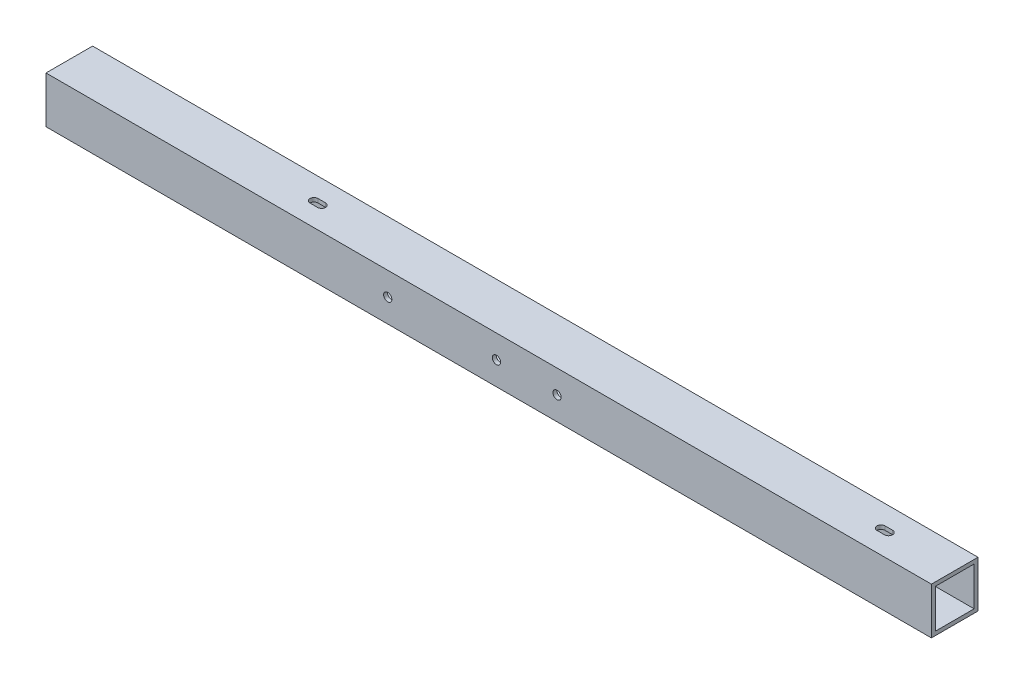
ISO-10303-21;
HEADER;
FILE_DESCRIPTION(('STEP AP214'),'2;1');
FILE_NAME('part.step','',(''),(''),'','','');
FILE_SCHEMA(('AUTOMOTIVE_DESIGN { 1 0 10303 214 1 1 1 1 }'));
ENDSEC;
DATA;
#1=APPLICATION_CONTEXT('core data for automotive mechanical design processes');
#2=APPLICATION_PROTOCOL_DEFINITION('international standard','automotive_design',2000,#1);
#3=PRODUCT_CONTEXT('',#1,'mechanical');
#4=PRODUCT('Part','Part','',(#3));
#5=PRODUCT_RELATED_PRODUCT_CATEGORY('part','',(#4));
#6=PRODUCT_DEFINITION_FORMATION('','',#4);
#7=PRODUCT_DEFINITION_CONTEXT('part definition',#1,'design');
#8=PRODUCT_DEFINITION('design','',#6,#7);
#9=PRODUCT_DEFINITION_SHAPE('','',#8);
#10=(LENGTH_UNIT() NAMED_UNIT(*) SI_UNIT(.MILLI.,.METRE.));
#11=(NAMED_UNIT(*) PLANE_ANGLE_UNIT() SI_UNIT($,.RADIAN.));
#12=(NAMED_UNIT(*) SI_UNIT($,.STERADIAN.) SOLID_ANGLE_UNIT());
#13=UNCERTAINTY_MEASURE_WITH_UNIT(LENGTH_MEASURE(1.E-05),#10,'distance_accuracy_value','');
#14=(GEOMETRIC_REPRESENTATION_CONTEXT(3) GLOBAL_UNCERTAINTY_ASSIGNED_CONTEXT((#13)) GLOBAL_UNIT_ASSIGNED_CONTEXT((#10,
#11,#12)) REPRESENTATION_CONTEXT('',''));
#15=CARTESIAN_POINT('',(0.,0.,0.));
#16=DIRECTION('',(0.,0.,1.));
#17=DIRECTION('',(1.,0.,0.));
#18=AXIS2_PLACEMENT_3D('',#15,#16,#17);
#19=CARTESIAN_POINT('',(-723.9,38.0999999999999,-38.1));
#20=DIRECTION('',(0.,-1.,0.));
#21=DIRECTION('',(1.,0.,0.));
#22=AXIS2_PLACEMENT_3D('',#19,#20,#21);
#23=PLANE('',#22);
#24=DIRECTION('',(1.,0.,0.));
#25=VECTOR('',#24,1.);
#26=CARTESIAN_POINT('',(-60.2361,38.1,-15.7861));
#27=LINE('',#26,#25);
#28=CARTESIAN_POINT('',(-60.2361,38.1,-15.7861));
#29=VERTEX_POINT('',#28);
#30=CARTESIAN_POINT('',(-54.0639,38.1,-15.7861));
#31=VERTEX_POINT('',#30);
#32=EDGE_CURVE('E252',#29,#31,#27,.T.);
#33=ORIENTED_EDGE('',*,*,#32,.F.);
#34=CARTESIAN_POINT('',(-60.2361,38.1,-19.05));
#35=DIRECTION('',(0.,-1.,0.));
#36=DIRECTION('',(0.,0.,-1.));
#37=AXIS2_PLACEMENT_3D('',#34,#35,#36);
#38=CIRCLE('',#37,3.26389999999999);
#39=CARTESIAN_POINT('',(-60.2361,38.1,-22.3139));
#40=VERTEX_POINT('',#39);
#41=EDGE_CURVE('E254',#29,#40,#38,.T.);
#42=ORIENTED_EDGE('',*,*,#41,.T.);
#43=DIRECTION('',(1.,0.,0.));
#44=VECTOR('',#43,1.);
#45=CARTESIAN_POINT('',(-60.2361,38.1,-22.3139));
#46=LINE('',#45,#44);
#47=CARTESIAN_POINT('',(-54.0639,38.1,-22.3139));
#48=VERTEX_POINT('',#47);
#49=EDGE_CURVE('E248',#40,#48,#46,.T.);
#50=ORIENTED_EDGE('',*,*,#49,.T.);
#51=CARTESIAN_POINT('',(-54.0639,38.1,-19.05));
#52=DIRECTION('',(0.,-1.,0.));
#53=DIRECTION('',(0.,0.,-1.));
#54=AXIS2_PLACEMENT_3D('',#51,#52,#53);
#55=CIRCLE('',#54,3.26389999999999);
#56=EDGE_CURVE('E255',#48,#31,#55,.T.);
#57=ORIENTED_EDGE('',*,*,#56,.T.);
#58=EDGE_LOOP('',(#33,#42,#50,#57));
#59=FACE_BOUND('',#58,.T.);
#60=DIRECTION('',(0.,0.,1.));
#61=VECTOR('',#60,1.);
#62=CARTESIAN_POINT('',(0.,38.1,-38.1));
#63=LINE('',#62,#61);
#64=CARTESIAN_POINT('',(0.,38.1,-38.1));
#65=VERTEX_POINT('',#64);
#66=CARTESIAN_POINT('',(0.,38.1,0.));
#67=VERTEX_POINT('',#66);
#68=EDGE_CURVE('E302',#65,#67,#63,.T.);
#69=ORIENTED_EDGE('',*,*,#68,.F.);
#70=DIRECTION('',(1.,0.,0.));
#71=VECTOR('',#70,1.);
#72=CARTESIAN_POINT('',(-723.9,38.0999999999999,-38.1));
#73=LINE('',#72,#71);
#74=CARTESIAN_POINT('',(-723.9,38.0999999999999,-38.1));
#75=VERTEX_POINT('',#74);
#76=EDGE_CURVE('E345',#75,#65,#73,.T.);
#77=ORIENTED_EDGE('',*,*,#76,.F.);
#78=DIRECTION('',(0.,0.,-1.));
#79=VECTOR('',#78,1.);
#80=CARTESIAN_POINT('',(-723.9,38.0999999999999,-38.1));
#81=LINE('',#80,#79);
#82=CARTESIAN_POINT('',(-723.9,38.0999999999999,0.));
#83=VERTEX_POINT('',#82);
#84=EDGE_CURVE('E320',#83,#75,#81,.T.);
#85=ORIENTED_EDGE('',*,*,#84,.F.);
#86=DIRECTION('',(1.,0.,0.));
#87=VECTOR('',#86,1.);
#88=CARTESIAN_POINT('',(-723.9,38.0999999999999,0.));
#89=LINE('',#88,#87);
#90=EDGE_CURVE('E348',#83,#67,#89,.T.);
#91=ORIENTED_EDGE('',*,*,#90,.T.);
#92=EDGE_LOOP('',(#69,#77,#85,#91));
#93=FACE_BOUND('',#92,.T.);
#94=DIRECTION('',(1.,0.,0.));
#95=VECTOR('',#94,1.);
#96=CARTESIAN_POINT('',(-523.7861,38.0999999999999,-15.7861));
#97=LINE('',#96,#95);
#98=CARTESIAN_POINT('',(-523.7861,38.0999999999999,-15.7861));
#99=VERTEX_POINT('',#98);
#100=CARTESIAN_POINT('',(-517.6139,38.0999999999999,-15.7861));
#101=VERTEX_POINT('',#100);
#102=EDGE_CURVE('E229',#99,#101,#97,.T.);
#103=ORIENTED_EDGE('',*,*,#102,.F.);
#104=CARTESIAN_POINT('',(-523.7861,38.0999999999999,-19.05));
#105=DIRECTION('',(0.,-1.,0.));
#106=DIRECTION('',(0.,0.,-1.));
#107=AXIS2_PLACEMENT_3D('',#104,#105,#106);
#108=CIRCLE('',#107,3.26389999999999);
#109=CARTESIAN_POINT('',(-523.7861,38.0999999999999,-22.3139));
#110=VERTEX_POINT('',#109);
#111=EDGE_CURVE('E226',#99,#110,#108,.T.);
#112=ORIENTED_EDGE('',*,*,#111,.T.);
#113=DIRECTION('',(1.,0.,0.));
#114=VECTOR('',#113,1.);
#115=CARTESIAN_POINT('',(-523.7861,38.0999999999999,-22.3139));
#116=LINE('',#115,#114);
#117=CARTESIAN_POINT('',(-517.6139,38.0999999999999,-22.3139));
#118=VERTEX_POINT('',#117);
#119=EDGE_CURVE('E207',#110,#118,#116,.T.);
#120=ORIENTED_EDGE('',*,*,#119,.T.);
#121=CARTESIAN_POINT('',(-517.6139,38.0999999999999,-19.05));
#122=DIRECTION('',(0.,-1.,0.));
#123=DIRECTION('',(0.,0.,-1.));
#124=AXIS2_PLACEMENT_3D('',#121,#122,#123);
#125=CIRCLE('',#124,3.26389999999999);
#126=EDGE_CURVE('E233',#118,#101,#125,.T.);
#127=ORIENTED_EDGE('',*,*,#126,.T.);
#128=EDGE_LOOP('',(#103,#112,#120,#127));
#129=FACE_BOUND('',#128,.T.);
#130=ADVANCED_FACE('F33',(#59,#93,#129),#23,.F.);
#131=CARTESIAN_POINT('',(-723.9,0.,-38.1));
#132=DIRECTION('',(0.,1.,0.));
#133=DIRECTION('',(-1.,0.,0.));
#134=AXIS2_PLACEMENT_3D('',#131,#132,#133);
#135=PLANE('',#134);
#136=DIRECTION('',(1.,0.,0.));
#137=VECTOR('',#136,1.);
#138=CARTESIAN_POINT('',(-523.7861,0.,-15.7861));
#139=LINE('',#138,#137);
#140=CARTESIAN_POINT('',(-523.7861,0.,-15.7861));
#141=VERTEX_POINT('',#140);
#142=CARTESIAN_POINT('',(-517.6139,0.,-15.7861));
#143=VERTEX_POINT('',#142);
#144=EDGE_CURVE('E196',#141,#143,#139,.T.);
#145=ORIENTED_EDGE('',*,*,#144,.T.);
#146=CARTESIAN_POINT('',(-517.6139,0.,-19.05));
#147=DIRECTION('',(0.,-1.,0.));
#148=DIRECTION('',(0.,0.,-1.));
#149=AXIS2_PLACEMENT_3D('',#146,#147,#148);
#150=CIRCLE('',#149,3.26389999999999);
#151=CARTESIAN_POINT('',(-517.6139,0.,-22.3139));
#152=VERTEX_POINT('',#151);
#153=EDGE_CURVE('E216',#152,#143,#150,.T.);
#154=ORIENTED_EDGE('',*,*,#153,.F.);
#155=DIRECTION('',(1.,0.,0.));
#156=VECTOR('',#155,1.);
#157=CARTESIAN_POINT('',(-523.7861,0.,-22.3139));
#158=LINE('',#157,#156);
#159=CARTESIAN_POINT('',(-523.7861,0.,-22.3139));
#160=VERTEX_POINT('',#159);
#161=EDGE_CURVE('E219',#160,#152,#158,.T.);
#162=ORIENTED_EDGE('',*,*,#161,.F.);
#163=CARTESIAN_POINT('',(-523.7861,0.,-19.05));
#164=DIRECTION('',(0.,-1.,0.));
#165=DIRECTION('',(0.,0.,-1.));
#166=AXIS2_PLACEMENT_3D('',#163,#164,#165);
#167=CIRCLE('',#166,3.26389999999999);
#168=EDGE_CURVE('E206',#141,#160,#167,.T.);
#169=ORIENTED_EDGE('',*,*,#168,.F.);
#170=EDGE_LOOP('',(#145,#154,#162,#169));
#171=FACE_BOUND('',#170,.T.);
#172=DIRECTION('',(1.,0.,0.));
#173=VECTOR('',#172,1.);
#174=CARTESIAN_POINT('',(-60.2361,0.,-22.3139));
#175=LINE('',#174,#173);
#176=CARTESIAN_POINT('',(-60.2361,0.,-22.3139));
#177=VERTEX_POINT('',#176);
#178=CARTESIAN_POINT('',(-54.0639,0.,-22.3139));
#179=VERTEX_POINT('',#178);
#180=EDGE_CURVE('E245',#177,#179,#175,.T.);
#181=ORIENTED_EDGE('',*,*,#180,.F.);
#182=CARTESIAN_POINT('',(-60.2361,0.,-19.05));
#183=DIRECTION('',(0.,-1.,0.));
#184=DIRECTION('',(0.,0.,-1.));
#185=AXIS2_PLACEMENT_3D('',#182,#183,#184);
#186=CIRCLE('',#185,3.26389999999999);
#187=CARTESIAN_POINT('',(-60.2361,0.,-15.7861));
#188=VERTEX_POINT('',#187);
#189=EDGE_CURVE('E258',#188,#177,#186,.T.);
#190=ORIENTED_EDGE('',*,*,#189,.F.);
#191=DIRECTION('',(1.,0.,0.));
#192=VECTOR('',#191,1.);
#193=CARTESIAN_POINT('',(-60.2361,0.,-15.7861));
#194=LINE('',#193,#192);
#195=CARTESIAN_POINT('',(-54.0639,0.,-15.7861));
#196=VERTEX_POINT('',#195);
#197=EDGE_CURVE('E251',#188,#196,#194,.T.);
#198=ORIENTED_EDGE('',*,*,#197,.T.);
#199=CARTESIAN_POINT('',(-54.0639,0.,-19.05));
#200=DIRECTION('',(0.,-1.,0.));
#201=DIRECTION('',(0.,0.,-1.));
#202=AXIS2_PLACEMENT_3D('',#199,#200,#201);
#203=CIRCLE('',#202,3.26389999999999);
#204=EDGE_CURVE('E271',#179,#196,#203,.T.);
#205=ORIENTED_EDGE('',*,*,#204,.F.);
#206=EDGE_LOOP('',(#181,#190,#198,#205));
#207=FACE_BOUND('',#206,.T.);
#208=DIRECTION('',(0.,0.,-1.));
#209=VECTOR('',#208,1.);
#210=CARTESIAN_POINT('',(0.,0.,-38.1));
#211=LINE('',#210,#209);
#212=CARTESIAN_POINT('',(0.,0.,0.));
#213=VERTEX_POINT('',#212);
#214=CARTESIAN_POINT('',(0.,0.,-38.1));
#215=VERTEX_POINT('',#214);
#216=EDGE_CURVE('E296',#213,#215,#211,.T.);
#217=ORIENTED_EDGE('',*,*,#216,.F.);
#218=DIRECTION('',(1.,0.,0.));
#219=VECTOR('',#218,1.);
#220=CARTESIAN_POINT('',(-723.9,0.,0.));
#221=LINE('',#220,#219);
#222=CARTESIAN_POINT('',(-723.9,0.,0.));
#223=VERTEX_POINT('',#222);
#224=EDGE_CURVE('E334',#223,#213,#221,.T.);
#225=ORIENTED_EDGE('',*,*,#224,.F.);
#226=DIRECTION('',(0.,0.,1.));
#227=VECTOR('',#226,1.);
#228=CARTESIAN_POINT('',(-723.9,0.,-38.1));
#229=LINE('',#228,#227);
#230=CARTESIAN_POINT('',(-723.9,-5.34294830600857E-13,-38.1));
#231=VERTEX_POINT('',#230);
#232=EDGE_CURVE('E326',#231,#223,#229,.T.);
#233=ORIENTED_EDGE('',*,*,#232,.F.);
#234=DIRECTION('',(1.,0.,0.));
#235=VECTOR('',#234,1.);
#236=CARTESIAN_POINT('',(-723.9,0.,-38.1));
#237=LINE('',#236,#235);
#238=EDGE_CURVE('E329',#231,#215,#237,.T.);
#239=ORIENTED_EDGE('',*,*,#238,.T.);
#240=EDGE_LOOP('',(#217,#225,#233,#239));
#241=FACE_BOUND('',#240,.T.);
#242=ADVANCED_FACE('F35',(#171,#207,#241),#135,.F.);
#243=CARTESIAN_POINT('',(-723.9,38.0999999999999,0.));
#244=DIRECTION('',(0.,0.,-1.));
#245=DIRECTION('',(-1.,0.,0.));
#246=AXIS2_PLACEMENT_3D('',#243,#244,#245);
#247=PLANE('',#246);
#248=CARTESIAN_POINT('',(-444.5,19.0499999999999,0.));
#249=DIRECTION('',(0.,0.,1.));
#250=DIRECTION('',(1.,0.,0.));
#251=AXIS2_PLACEMENT_3D('',#248,#249,#250);
#252=CIRCLE('',#251,3.3782);
#253=CARTESIAN_POINT('',(-441.1218,19.0499999999999,0.));
#254=VERTEX_POINT('',#253);
#255=EDGE_CURVE('E450',#254,#254,#252,.T.);
#256=ORIENTED_EDGE('',*,*,#255,.F.);
#257=EDGE_LOOP('',(#256));
#258=FACE_BOUND('',#257,.T.);
#259=CARTESIAN_POINT('',(-355.6,19.0499999999999,0.));
#260=DIRECTION('',(0.,0.,1.));
#261=DIRECTION('',(1.,0.,0.));
#262=AXIS2_PLACEMENT_3D('',#259,#260,#261);
#263=CIRCLE('',#262,3.3782);
#264=CARTESIAN_POINT('',(-352.2218,19.0499999999999,0.));
#265=VERTEX_POINT('',#264);
#266=EDGE_CURVE('E454',#265,#265,#263,.T.);
#267=ORIENTED_EDGE('',*,*,#266,.F.);
#268=EDGE_LOOP('',(#267));
#269=FACE_BOUND('',#268,.T.);
#270=CARTESIAN_POINT('',(-306.07,19.05,0.));
#271=DIRECTION('',(0.,0.,1.));
#272=DIRECTION('',(1.,0.,0.));
#273=AXIS2_PLACEMENT_3D('',#270,#271,#272);
#274=CIRCLE('',#273,3.3782);
#275=CARTESIAN_POINT('',(-302.6918,19.05,0.));
#276=VERTEX_POINT('',#275);
#277=EDGE_CURVE('E386',#276,#276,#274,.T.);
#278=ORIENTED_EDGE('',*,*,#277,.F.);
#279=EDGE_LOOP('',(#278));
#280=FACE_BOUND('',#279,.T.);
#281=DIRECTION('',(0.,-1.,0.));
#282=VECTOR('',#281,1.);
#283=CARTESIAN_POINT('',(0.,38.0999999999999,0.));
#284=LINE('',#283,#282);
#285=EDGE_CURVE('E299',#67,#213,#284,.T.);
#286=ORIENTED_EDGE('',*,*,#285,.F.);
#287=ORIENTED_EDGE('',*,*,#90,.F.);
#288=DIRECTION('',(0.,1.,0.));
#289=VECTOR('',#288,1.);
#290=CARTESIAN_POINT('',(-723.9,38.0999999999999,0.));
#291=LINE('',#290,#289);
#292=EDGE_CURVE('E323',#223,#83,#291,.T.);
#293=ORIENTED_EDGE('',*,*,#292,.F.);
#294=ORIENTED_EDGE('',*,*,#224,.T.);
#295=EDGE_LOOP('',(#286,#287,#293,#294));
#296=FACE_BOUND('',#295,.T.);
#297=ADVANCED_FACE('F434',(#258,#269,#280,#296),#247,.F.);
#298=CARTESIAN_POINT('',(-723.9,38.0999999999999,-38.1));
#299=DIRECTION('',(0.,0.,1.));
#300=DIRECTION('',(1.,0.,0.));
#301=AXIS2_PLACEMENT_3D('',#298,#299,#300);
#302=PLANE('',#301);
#303=CARTESIAN_POINT('',(-444.5,19.0499999999999,-38.1));
#304=DIRECTION('',(0.,0.,1.));
#305=DIRECTION('',(1.,0.,0.));
#306=AXIS2_PLACEMENT_3D('',#303,#304,#305);
#307=CIRCLE('',#306,3.3782);
#308=CARTESIAN_POINT('',(-441.1218,19.0499999999999,-38.1));
#309=VERTEX_POINT('',#308);
#310=EDGE_CURVE('E709',#309,#309,#307,.T.);
#311=ORIENTED_EDGE('',*,*,#310,.T.);
#312=EDGE_LOOP('',(#311));
#313=FACE_BOUND('',#312,.T.);
#314=CARTESIAN_POINT('',(-355.6,19.0499999999999,-38.1));
#315=DIRECTION('',(0.,0.,1.));
#316=DIRECTION('',(1.,0.,0.));
#317=AXIS2_PLACEMENT_3D('',#314,#315,#316);
#318=CIRCLE('',#317,3.3782);
#319=CARTESIAN_POINT('',(-352.2218,19.0499999999999,-38.1));
#320=VERTEX_POINT('',#319);
#321=EDGE_CURVE('E716',#320,#320,#318,.T.);
#322=ORIENTED_EDGE('',*,*,#321,.T.);
#323=EDGE_LOOP('',(#322));
#324=FACE_BOUND('',#323,.T.);
#325=CARTESIAN_POINT('',(-306.07,19.05,-38.1));
#326=DIRECTION('',(0.,0.,1.));
#327=DIRECTION('',(1.,0.,0.));
#328=AXIS2_PLACEMENT_3D('',#325,#326,#327);
#329=CIRCLE('',#328,3.3782);
#330=CARTESIAN_POINT('',(-302.6918,19.05,-38.1));
#331=VERTEX_POINT('',#330);
#332=EDGE_CURVE('E380',#331,#331,#329,.T.);
#333=ORIENTED_EDGE('',*,*,#332,.T.);
#334=EDGE_LOOP('',(#333));
#335=FACE_BOUND('',#334,.T.);
#336=DIRECTION('',(0.,1.,0.));
#337=VECTOR('',#336,1.);
#338=CARTESIAN_POINT('',(0.,38.0999999999999,-38.1));
#339=LINE('',#338,#337);
#340=EDGE_CURVE('E305',#215,#65,#339,.T.);
#341=ORIENTED_EDGE('',*,*,#340,.F.);
#342=ORIENTED_EDGE('',*,*,#238,.F.);
#343=DIRECTION('',(0.,-1.,0.));
#344=VECTOR('',#343,1.);
#345=CARTESIAN_POINT('',(-723.9,38.0999999999999,-38.1));
#346=LINE('',#345,#344);
#347=EDGE_CURVE('E317',#75,#231,#346,.T.);
#348=ORIENTED_EDGE('',*,*,#347,.F.);
#349=ORIENTED_EDGE('',*,*,#76,.T.);
#350=EDGE_LOOP('',(#341,#342,#348,#349));
#351=FACE_BOUND('',#350,.T.);
#352=ADVANCED_FACE('F438',(#313,#324,#335,#351),#302,.F.);
#353=CARTESIAN_POINT('',(-723.9,-2.22044604925031E-13,-38.1));
#354=DIRECTION('',(-1.,0.,0.));
#355=DIRECTION('',(0.,-1.,0.));
#356=AXIS2_PLACEMENT_3D('',#353,#354,#355);
#357=PLANE('',#356);
#358=DIRECTION('',(0.,0.,1.));
#359=VECTOR('',#358,1.);
#360=CARTESIAN_POINT('',(-723.9,3.17499999999991,-34.925));
#361=LINE('',#360,#359);
#362=CARTESIAN_POINT('',(-723.9,3.17499999999947,-34.925));
#363=VERTEX_POINT('',#362);
#364=CARTESIAN_POINT('',(-723.9,3.17499999999947,-3.175));
#365=VERTEX_POINT('',#364);
#366=EDGE_CURVE('E314',#363,#365,#361,.T.);
#367=ORIENTED_EDGE('',*,*,#366,.F.);
#368=DIRECTION('',(0.,-1.,0.));
#369=VECTOR('',#368,1.);
#370=CARTESIAN_POINT('',(-723.9,34.9249999999999,-34.925));
#371=LINE('',#370,#369);
#372=CARTESIAN_POINT('',(-723.9,34.9249999999999,-34.925));
#373=VERTEX_POINT('',#372);
#374=EDGE_CURVE('E311',#373,#363,#371,.T.);
#375=ORIENTED_EDGE('',*,*,#374,.F.);
#376=DIRECTION('',(0.,0.,-1.));
#377=VECTOR('',#376,1.);
#378=CARTESIAN_POINT('',(-723.9,34.9249999999999,-34.925));
#379=LINE('',#378,#377);
#380=CARTESIAN_POINT('',(-723.9,34.9249999999999,-3.175));
#381=VERTEX_POINT('',#380);
#382=EDGE_CURVE('E308',#381,#373,#379,.T.);
#383=ORIENTED_EDGE('',*,*,#382,.F.);
#384=DIRECTION('',(0.,1.,0.));
#385=VECTOR('',#384,1.);
#386=CARTESIAN_POINT('',(-723.9,34.9249999999999,-3.175));
#387=LINE('',#386,#385);
#388=EDGE_CURVE('E343',#365,#381,#387,.T.);
#389=ORIENTED_EDGE('',*,*,#388,.F.);
#390=EDGE_LOOP('',(#367,#375,#383,#389));
#391=FACE_BOUND('',#390,.T.);
#392=ORIENTED_EDGE('',*,*,#347,.T.);
#393=ORIENTED_EDGE('',*,*,#232,.T.);
#394=ORIENTED_EDGE('',*,*,#292,.T.);
#395=ORIENTED_EDGE('',*,*,#84,.T.);
#396=EDGE_LOOP('',(#392,#393,#394,#395));
#397=FACE_BOUND('',#396,.T.);
#398=ADVANCED_FACE('F445',(#391,#397),#357,.T.);
#399=CARTESIAN_POINT('',(-723.9,3.17499999999991,-34.925));
#400=DIRECTION('',(0.,1.,0.));
#401=DIRECTION('',(-1.,0.,0.));
#402=AXIS2_PLACEMENT_3D('',#399,#400,#401);
#403=PLANE('',#402);
#404=DIRECTION('',(1.,0.,0.));
#405=VECTOR('',#404,1.);
#406=CARTESIAN_POINT('',(-723.9,3.17499999999991,-15.7861));
#407=LINE('',#406,#405);
#408=CARTESIAN_POINT('',(-523.7861,3.17499999999994,-15.7861));
#409=VERTEX_POINT('',#408);
#410=CARTESIAN_POINT('',(-517.6139,3.17499999999994,-15.7861));
#411=VERTEX_POINT('',#410);
#412=EDGE_CURVE('E242',#409,#411,#407,.T.);
#413=ORIENTED_EDGE('',*,*,#412,.F.);
#414=CARTESIAN_POINT('',(-523.7861,3.17499999999994,-19.05));
#415=DIRECTION('',(0.,1.,0.));
#416=DIRECTION('',(-1.,0.,0.));
#417=AXIS2_PLACEMENT_3D('',#414,#415,#416);
#418=CIRCLE('',#417,3.26389999999999);
#419=CARTESIAN_POINT('',(-523.7861,3.17499999999994,-22.3139));
#420=VERTEX_POINT('',#419);
#421=EDGE_CURVE('E215',#420,#409,#418,.T.);
#422=ORIENTED_EDGE('',*,*,#421,.F.);
#423=DIRECTION('',(-1.,0.,0.));
#424=VECTOR('',#423,1.);
#425=CARTESIAN_POINT('',(-723.9,3.17499999999991,-22.3139));
#426=LINE('',#425,#424);
#427=CARTESIAN_POINT('',(-517.6139,3.17499999999994,-22.3139));
#428=VERTEX_POINT('',#427);
#429=EDGE_CURVE('E42',#428,#420,#426,.T.);
#430=ORIENTED_EDGE('',*,*,#429,.F.);
#431=CARTESIAN_POINT('',(-517.6139,3.17499999999994,-19.05));
#432=DIRECTION('',(0.,1.,0.));
#433=DIRECTION('',(-1.,0.,0.));
#434=AXIS2_PLACEMENT_3D('',#431,#432,#433);
#435=CIRCLE('',#434,3.26389999999999);
#436=EDGE_CURVE('E11',#411,#428,#435,.T.);
#437=ORIENTED_EDGE('',*,*,#436,.F.);
#438=EDGE_LOOP('',(#413,#422,#430,#437));
#439=FACE_BOUND('',#438,.T.);
#440=DIRECTION('',(-1.,0.,0.));
#441=VECTOR('',#440,1.);
#442=CARTESIAN_POINT('',(-723.9,3.17499999999991,-22.3139));
#443=LINE('',#442,#441);
#444=CARTESIAN_POINT('',(-54.0639,3.17499999999999,-22.3139));
#445=VERTEX_POINT('',#444);
#446=CARTESIAN_POINT('',(-60.2361,3.17499999999999,-22.3139));
#447=VERTEX_POINT('',#446);
#448=EDGE_CURVE('E369',#445,#447,#443,.T.);
#449=ORIENTED_EDGE('',*,*,#448,.F.);
#450=CARTESIAN_POINT('',(-54.0639,3.17499999999999,-19.05));
#451=DIRECTION('',(0.,1.,0.));
#452=DIRECTION('',(-1.,0.,0.));
#453=AXIS2_PLACEMENT_3D('',#450,#451,#452);
#454=CIRCLE('',#453,3.26389999999999);
#455=CARTESIAN_POINT('',(-54.0639,3.17499999999999,-15.7861));
#456=VERTEX_POINT('',#455);
#457=EDGE_CURVE('E285',#456,#445,#454,.T.);
#458=ORIENTED_EDGE('',*,*,#457,.F.);
#459=DIRECTION('',(1.,0.,0.));
#460=VECTOR('',#459,1.);
#461=CARTESIAN_POINT('',(-723.9,3.17499999999991,-15.7861));
#462=LINE('',#461,#460);
#463=CARTESIAN_POINT('',(-60.2360999999999,3.17499999999999,-15.7861));
#464=VERTEX_POINT('',#463);
#465=EDGE_CURVE('E364',#464,#456,#462,.T.);
#466=ORIENTED_EDGE('',*,*,#465,.F.);
#467=CARTESIAN_POINT('',(-60.2361,3.17499999999999,-19.05));
#468=DIRECTION('',(0.,1.,0.));
#469=DIRECTION('',(-1.,0.,0.));
#470=AXIS2_PLACEMENT_3D('',#467,#468,#469);
#471=CIRCLE('',#470,3.26389999999999);
#472=EDGE_CURVE('E366',#447,#464,#471,.T.);
#473=ORIENTED_EDGE('',*,*,#472,.F.);
#474=EDGE_LOOP('',(#449,#458,#466,#473));
#475=FACE_BOUND('',#474,.T.);
#476=DIRECTION('',(1.,0.,0.));
#477=VECTOR('',#476,1.);
#478=CARTESIAN_POINT('',(-723.9,3.17499999999991,-3.175));
#479=LINE('',#478,#477);
#480=CARTESIAN_POINT('',(0.,3.175,-3.175));
#481=VERTEX_POINT('',#480);
#482=EDGE_CURVE('E330',#365,#481,#479,.T.);
#483=ORIENTED_EDGE('',*,*,#482,.T.);
#484=DIRECTION('',(0.,0.,-1.));
#485=VECTOR('',#484,1.);
#486=CARTESIAN_POINT('',(0.,3.175,-34.925));
#487=LINE('',#486,#485);
#488=CARTESIAN_POINT('',(0.,3.175,-34.925));
#489=VERTEX_POINT('',#488);
#490=EDGE_CURVE('E354',#481,#489,#487,.T.);
#491=ORIENTED_EDGE('',*,*,#490,.T.);
#492=DIRECTION('',(1.,0.,0.));
#493=VECTOR('',#492,1.);
#494=CARTESIAN_POINT('',(-723.9,3.17499999999991,-34.925));
#495=LINE('',#494,#493);
#496=EDGE_CURVE('E340',#363,#489,#495,.T.);
#497=ORIENTED_EDGE('',*,*,#496,.F.);
#498=ORIENTED_EDGE('',*,*,#366,.T.);
#499=EDGE_LOOP('',(#483,#491,#497,#498));
#500=FACE_BOUND('',#499,.T.);
#501=ADVANCED_FACE('F469',(#439,#475,#500),#403,.T.);
#502=CARTESIAN_POINT('',(-723.9,34.9249999999999,-34.925));
#503=DIRECTION('',(0.,0.,1.));
#504=DIRECTION('',(1.,0.,0.));
#505=AXIS2_PLACEMENT_3D('',#502,#503,#504);
#506=PLANE('',#505);
#507=CARTESIAN_POINT('',(-444.5,19.0499999999999,-34.925));
#508=DIRECTION('',(0.,0.,1.));
#509=DIRECTION('',(1.,0.,0.));
#510=AXIS2_PLACEMENT_3D('',#507,#508,#509);
#511=CIRCLE('',#510,3.3782);
#512=CARTESIAN_POINT('',(-441.1218,19.0499999999999,-34.925));
#513=VERTEX_POINT('',#512);
#514=EDGE_CURVE('E37',#513,#513,#511,.T.);
#515=ORIENTED_EDGE('',*,*,#514,.F.);
#516=EDGE_LOOP('',(#515));
#517=FACE_BOUND('',#516,.T.);
#518=CARTESIAN_POINT('',(-355.6,19.0499999999999,-34.925));
#519=DIRECTION('',(0.,0.,1.));
#520=DIRECTION('',(1.,0.,0.));
#521=AXIS2_PLACEMENT_3D('',#518,#519,#520);
#522=CIRCLE('',#521,3.3782);
#523=CARTESIAN_POINT('',(-352.2218,19.0499999999999,-34.925));
#524=VERTEX_POINT('',#523);
#525=EDGE_CURVE('E391',#524,#524,#522,.T.);
#526=ORIENTED_EDGE('',*,*,#525,.F.);
#527=EDGE_LOOP('',(#526));
#528=FACE_BOUND('',#527,.T.);
#529=CARTESIAN_POINT('',(-306.07,19.05,-34.925));
#530=DIRECTION('',(0.,0.,1.));
#531=DIRECTION('',(1.,0.,0.));
#532=AXIS2_PLACEMENT_3D('',#529,#530,#531);
#533=CIRCLE('',#532,3.3782);
#534=CARTESIAN_POINT('',(-302.6918,19.05,-34.925));
#535=VERTEX_POINT('',#534);
#536=EDGE_CURVE('E379',#535,#535,#533,.T.);
#537=ORIENTED_EDGE('',*,*,#536,.F.);
#538=EDGE_LOOP('',(#537));
#539=FACE_BOUND('',#538,.T.);
#540=ORIENTED_EDGE('',*,*,#496,.T.);
#541=DIRECTION('',(0.,1.,0.));
#542=VECTOR('',#541,1.);
#543=CARTESIAN_POINT('',(0.,34.9249999999999,-34.925));
#544=LINE('',#543,#542);
#545=CARTESIAN_POINT('',(0.,34.9250000000004,-34.925));
#546=VERTEX_POINT('',#545);
#547=EDGE_CURVE('E287',#489,#546,#544,.T.);
#548=ORIENTED_EDGE('',*,*,#547,.T.);
#549=DIRECTION('',(1.,0.,0.));
#550=VECTOR('',#549,1.);
#551=CARTESIAN_POINT('',(-723.9,34.9249999999999,-34.925));
#552=LINE('',#551,#550);
#553=EDGE_CURVE('E337',#373,#546,#552,.T.);
#554=ORIENTED_EDGE('',*,*,#553,.F.);
#555=ORIENTED_EDGE('',*,*,#374,.T.);
#556=EDGE_LOOP('',(#540,#548,#554,#555));
#557=FACE_BOUND('',#556,.T.);
#558=ADVANCED_FACE('F475',(#517,#528,#539,#557),#506,.T.);
#559=CARTESIAN_POINT('',(-723.9,34.9249999999999,-34.925));
#560=DIRECTION('',(0.,-1.,0.));
#561=DIRECTION('',(1.,0.,0.));
#562=AXIS2_PLACEMENT_3D('',#559,#560,#561);
#563=PLANE('',#562);
#564=CARTESIAN_POINT('',(-517.6139,34.9249999999999,-19.05));
#565=DIRECTION('',(0.,-1.,0.));
#566=DIRECTION('',(1.,0.,0.));
#567=AXIS2_PLACEMENT_3D('',#564,#565,#566);
#568=CIRCLE('',#567,3.26389999999999);
#569=CARTESIAN_POINT('',(-517.6139,34.9249999999999,-22.3139));
#570=VERTEX_POINT('',#569);
#571=CARTESIAN_POINT('',(-517.6139,34.9249999999999,-15.7861));
#572=VERTEX_POINT('',#571);
#573=EDGE_CURVE('E375',#570,#572,#568,.T.);
#574=ORIENTED_EDGE('',*,*,#573,.F.);
#575=DIRECTION('',(1.,0.,0.));
#576=VECTOR('',#575,1.);
#577=CARTESIAN_POINT('',(-723.9,34.9249999999999,-22.3139));
#578=LINE('',#577,#576);
#579=CARTESIAN_POINT('',(-523.7861,34.9249999999999,-22.3139));
#580=VERTEX_POINT('',#579);
#581=EDGE_CURVE('E373',#580,#570,#578,.T.);
#582=ORIENTED_EDGE('',*,*,#581,.F.);
#583=CARTESIAN_POINT('',(-523.7861,34.9249999999999,-19.05));
#584=DIRECTION('',(0.,-1.,0.));
#585=DIRECTION('',(1.,0.,0.));
#586=AXIS2_PLACEMENT_3D('',#583,#584,#585);
#587=CIRCLE('',#586,3.26389999999999);
#588=CARTESIAN_POINT('',(-523.7861,34.9249999999999,-15.7861));
#589=VERTEX_POINT('',#588);
#590=EDGE_CURVE('E371',#589,#580,#587,.T.);
#591=ORIENTED_EDGE('',*,*,#590,.F.);
#592=DIRECTION('',(-1.,0.,0.));
#593=VECTOR('',#592,1.);
#594=CARTESIAN_POINT('',(-723.9,34.9249999999999,-15.7861));
#595=LINE('',#594,#593);
#596=EDGE_CURVE('E228',#572,#589,#595,.T.);
#597=ORIENTED_EDGE('',*,*,#596,.F.);
#598=EDGE_LOOP('',(#574,#582,#591,#597));
#599=FACE_BOUND('',#598,.T.);
#600=CARTESIAN_POINT('',(-60.2361,34.925,-19.05));
#601=DIRECTION('',(0.,-1.,0.));
#602=DIRECTION('',(1.,0.,0.));
#603=AXIS2_PLACEMENT_3D('',#600,#601,#602);
#604=CIRCLE('',#603,3.26389999999999);
#605=CARTESIAN_POINT('',(-60.2361,34.925,-15.7861));
#606=VERTEX_POINT('',#605);
#607=CARTESIAN_POINT('',(-60.2361,34.925,-22.3139));
#608=VERTEX_POINT('',#607);
#609=EDGE_CURVE('E362',#606,#608,#604,.T.);
#610=ORIENTED_EDGE('',*,*,#609,.F.);
#611=DIRECTION('',(-1.,0.,0.));
#612=VECTOR('',#611,1.);
#613=CARTESIAN_POINT('',(-723.9,34.9249999999999,-15.7861));
#614=LINE('',#613,#612);
#615=CARTESIAN_POINT('',(-54.0639,34.925,-15.7861));
#616=VERTEX_POINT('',#615);
#617=EDGE_CURVE('E360',#616,#606,#614,.T.);
#618=ORIENTED_EDGE('',*,*,#617,.F.);
#619=CARTESIAN_POINT('',(-54.0639,34.925,-19.05));
#620=DIRECTION('',(0.,-1.,0.));
#621=DIRECTION('',(1.,0.,0.));
#622=AXIS2_PLACEMENT_3D('',#619,#620,#621);
#623=CIRCLE('',#622,3.26389999999999);
#624=CARTESIAN_POINT('',(-54.0639,34.925,-22.3139));
#625=VERTEX_POINT('',#624);
#626=EDGE_CURVE('E264',#625,#616,#623,.T.);
#627=ORIENTED_EDGE('',*,*,#626,.F.);
#628=DIRECTION('',(1.,0.,0.));
#629=VECTOR('',#628,1.);
#630=CARTESIAN_POINT('',(-723.9,34.9249999999999,-22.3139));
#631=LINE('',#630,#629);
#632=EDGE_CURVE('E357',#608,#625,#631,.T.);
#633=ORIENTED_EDGE('',*,*,#632,.F.);
#634=EDGE_LOOP('',(#610,#618,#627,#633));
#635=FACE_BOUND('',#634,.T.);
#636=ORIENTED_EDGE('',*,*,#553,.T.);
#637=DIRECTION('',(0.,0.,1.));
#638=VECTOR('',#637,1.);
#639=CARTESIAN_POINT('',(0.,34.925,-34.925));
#640=LINE('',#639,#638);
#641=CARTESIAN_POINT('',(0.,34.925,-3.175));
#642=VERTEX_POINT('',#641);
#643=EDGE_CURVE('E290',#546,#642,#640,.T.);
#644=ORIENTED_EDGE('',*,*,#643,.T.);
#645=DIRECTION('',(1.,0.,0.));
#646=VECTOR('',#645,1.);
#647=CARTESIAN_POINT('',(-723.9,34.9249999999999,-3.175));
#648=LINE('',#647,#646);
#649=EDGE_CURVE('E333',#381,#642,#648,.T.);
#650=ORIENTED_EDGE('',*,*,#649,.F.);
#651=ORIENTED_EDGE('',*,*,#382,.T.);
#652=EDGE_LOOP('',(#636,#644,#650,#651));
#653=FACE_BOUND('',#652,.T.);
#654=ADVANCED_FACE('F413',(#599,#635,#653),#563,.T.);
#655=CARTESIAN_POINT('',(-723.9,34.9249999999999,-3.175));
#656=DIRECTION('',(0.,0.,-1.));
#657=DIRECTION('',(-1.,0.,0.));
#658=AXIS2_PLACEMENT_3D('',#655,#656,#657);
#659=PLANE('',#658);
#660=CARTESIAN_POINT('',(-444.5,19.0499999999999,-3.175));
#661=DIRECTION('',(0.,0.,-1.));
#662=DIRECTION('',(-1.,0.,0.));
#663=AXIS2_PLACEMENT_3D('',#660,#661,#662);
#664=CIRCLE('',#663,3.3782);
#665=CARTESIAN_POINT('',(-447.8782,19.0499999999999,-3.175));
#666=VERTEX_POINT('',#665);
#667=EDGE_CURVE('E708',#666,#666,#664,.T.);
#668=ORIENTED_EDGE('',*,*,#667,.F.);
#669=EDGE_LOOP('',(#668));
#670=FACE_BOUND('',#669,.T.);
#671=CARTESIAN_POINT('',(-355.6,19.0499999999999,-3.175));
#672=DIRECTION('',(0.,0.,-1.));
#673=DIRECTION('',(-1.,0.,0.));
#674=AXIS2_PLACEMENT_3D('',#671,#672,#673);
#675=CIRCLE('',#674,3.3782);
#676=CARTESIAN_POINT('',(-358.9782,19.0499999999999,-3.175));
#677=VERTEX_POINT('',#676);
#678=EDGE_CURVE('E719',#677,#677,#675,.T.);
#679=ORIENTED_EDGE('',*,*,#678,.F.);
#680=EDGE_LOOP('',(#679));
#681=FACE_BOUND('',#680,.T.);
#682=CARTESIAN_POINT('',(-306.07,19.05,-3.175));
#683=DIRECTION('',(0.,0.,-1.));
#684=DIRECTION('',(-1.,0.,0.));
#685=AXIS2_PLACEMENT_3D('',#682,#683,#684);
#686=CIRCLE('',#685,3.3782);
#687=CARTESIAN_POINT('',(-309.4482,19.05,-3.175));
#688=VERTEX_POINT('',#687);
#689=EDGE_CURVE('E377',#688,#688,#686,.T.);
#690=ORIENTED_EDGE('',*,*,#689,.F.);
#691=EDGE_LOOP('',(#690));
#692=FACE_BOUND('',#691,.T.);
#693=ORIENTED_EDGE('',*,*,#649,.T.);
#694=DIRECTION('',(0.,-1.,0.));
#695=VECTOR('',#694,1.);
#696=CARTESIAN_POINT('',(0.,34.9249999999999,-3.175));
#697=LINE('',#696,#695);
#698=EDGE_CURVE('E293',#642,#481,#697,.T.);
#699=ORIENTED_EDGE('',*,*,#698,.T.);
#700=ORIENTED_EDGE('',*,*,#482,.F.);
#701=ORIENTED_EDGE('',*,*,#388,.T.);
#702=EDGE_LOOP('',(#693,#699,#700,#701));
#703=FACE_BOUND('',#702,.T.);
#704=ADVANCED_FACE('F480',(#670,#681,#692,#703),#659,.T.);
#705=CARTESIAN_POINT('',(0.,0.,0.));
#706=DIRECTION('',(1.,0.,0.));
#707=DIRECTION('',(0.,0.,-1.));
#708=AXIS2_PLACEMENT_3D('',#705,#706,#707);
#709=PLANE('',#708);
#710=ORIENTED_EDGE('',*,*,#698,.F.);
#711=ORIENTED_EDGE('',*,*,#643,.F.);
#712=ORIENTED_EDGE('',*,*,#547,.F.);
#713=ORIENTED_EDGE('',*,*,#490,.F.);
#714=EDGE_LOOP('',(#710,#711,#712,#713));
#715=FACE_BOUND('',#714,.T.);
#716=ORIENTED_EDGE('',*,*,#216,.T.);
#717=ORIENTED_EDGE('',*,*,#340,.T.);
#718=ORIENTED_EDGE('',*,*,#68,.T.);
#719=ORIENTED_EDGE('',*,*,#285,.T.);
#720=EDGE_LOOP('',(#716,#717,#718,#719));
#721=FACE_BOUND('',#720,.T.);
#722=ADVANCED_FACE('F461',(#715,#721),#709,.T.);
#723=CARTESIAN_POINT('',(-60.2361,0.,-15.7861));
#724=DIRECTION('',(0.,0.,1.));
#725=DIRECTION('',(1.,0.,0.));
#726=AXIS2_PLACEMENT_3D('',#723,#724,#725);
#727=PLANE('',#726);
#728=ORIENTED_EDGE('',*,*,#465,.T.);
#729=DIRECTION('',(0.,-1.,0.));
#730=VECTOR('',#729,1.);
#731=CARTESIAN_POINT('',(-54.0639,0.,-15.7861));
#732=LINE('',#731,#730);
#733=EDGE_CURVE('E274',#456,#196,#732,.T.);
#734=ORIENTED_EDGE('',*,*,#733,.T.);
#735=ORIENTED_EDGE('',*,*,#197,.F.);
#736=DIRECTION('',(0.,-1.,0.));
#737=VECTOR('',#736,1.);
#738=CARTESIAN_POINT('',(-60.2361,0.,-15.7861));
#739=LINE('',#738,#737);
#740=EDGE_CURVE('E269',#188,#464,#739,.F.);
#741=ORIENTED_EDGE('',*,*,#740,.T.);
#742=EDGE_LOOP('',(#728,#734,#735,#741));
#743=FACE_BOUND('',#742,.T.);
#744=ADVANCED_FACE('F507',(#743),#727,.F.);
#745=CARTESIAN_POINT('',(-54.0639,0.,-19.05));
#746=DIRECTION('',(0.,-1.,0.));
#747=DIRECTION('',(0.,0.,-1.));
#748=AXIS2_PLACEMENT_3D('',#745,#746,#747);
#749=CYLINDRICAL_SURFACE('',#748,3.26389999999999);
#750=ORIENTED_EDGE('',*,*,#457,.T.);
#751=DIRECTION('',(0.,-1.,0.));
#752=VECTOR('',#751,1.);
#753=CARTESIAN_POINT('',(-54.0639,0.,-22.3139));
#754=LINE('',#753,#752);
#755=EDGE_CURVE('E277',#179,#445,#754,.F.);
#756=ORIENTED_EDGE('',*,*,#755,.F.);
#757=ORIENTED_EDGE('',*,*,#204,.T.);
#758=ORIENTED_EDGE('',*,*,#733,.F.);
#759=EDGE_LOOP('',(#750,#756,#757,#758));
#760=FACE_BOUND('',#759,.T.);
#761=ADVANCED_FACE('F511',(#760),#749,.F.);
#762=CARTESIAN_POINT('',(-60.2361,0.,-19.05));
#763=DIRECTION('',(0.,-1.,0.));
#764=DIRECTION('',(0.,0.,-1.));
#765=AXIS2_PLACEMENT_3D('',#762,#763,#764);
#766=CYLINDRICAL_SURFACE('',#765,3.26389999999999);
#767=ORIENTED_EDGE('',*,*,#472,.T.);
#768=ORIENTED_EDGE('',*,*,#740,.F.);
#769=ORIENTED_EDGE('',*,*,#189,.T.);
#770=DIRECTION('',(0.,-1.,0.));
#771=VECTOR('',#770,1.);
#772=CARTESIAN_POINT('',(-60.2361,0.,-22.3139));
#773=LINE('',#772,#771);
#774=EDGE_CURVE('E261',#447,#177,#773,.T.);
#775=ORIENTED_EDGE('',*,*,#774,.F.);
#776=EDGE_LOOP('',(#767,#768,#769,#775));
#777=FACE_BOUND('',#776,.T.);
#778=ADVANCED_FACE('F518',(#777),#766,.F.);
#779=CARTESIAN_POINT('',(-60.2361,0.,-22.3139));
#780=DIRECTION('',(0.,0.,-1.));
#781=DIRECTION('',(-1.,0.,0.));
#782=AXIS2_PLACEMENT_3D('',#779,#780,#781);
#783=PLANE('',#782);
#784=ORIENTED_EDGE('',*,*,#448,.T.);
#785=ORIENTED_EDGE('',*,*,#774,.T.);
#786=ORIENTED_EDGE('',*,*,#180,.T.);
#787=ORIENTED_EDGE('',*,*,#755,.T.);
#788=EDGE_LOOP('',(#784,#785,#786,#787));
#789=FACE_BOUND('',#788,.T.);
#790=ADVANCED_FACE('F524',(#789),#783,.F.);
#791=ORIENTED_EDGE('',*,*,#617,.T.);
#792=EDGE_CURVE('E268',#606,#29,#739,.F.);
#793=ORIENTED_EDGE('',*,*,#792,.T.);
#794=ORIENTED_EDGE('',*,*,#32,.T.);
#795=EDGE_CURVE('E278',#31,#616,#732,.T.);
#796=ORIENTED_EDGE('',*,*,#795,.T.);
#797=EDGE_LOOP('',(#791,#793,#794,#796));
#798=FACE_BOUND('',#797,.T.);
#799=ADVANCED_FACE('F514',(#798),#727,.F.);
#800=ORIENTED_EDGE('',*,*,#626,.T.);
#801=ORIENTED_EDGE('',*,*,#795,.F.);
#802=ORIENTED_EDGE('',*,*,#56,.F.);
#803=EDGE_CURVE('E281',#625,#48,#754,.F.);
#804=ORIENTED_EDGE('',*,*,#803,.F.);
#805=EDGE_LOOP('',(#800,#801,#802,#804));
#806=FACE_BOUND('',#805,.T.);
#807=ADVANCED_FACE('F520',(#806),#749,.F.);
#808=ORIENTED_EDGE('',*,*,#609,.T.);
#809=EDGE_CURVE('E265',#40,#608,#773,.T.);
#810=ORIENTED_EDGE('',*,*,#809,.F.);
#811=ORIENTED_EDGE('',*,*,#41,.F.);
#812=ORIENTED_EDGE('',*,*,#792,.F.);
#813=EDGE_LOOP('',(#808,#810,#811,#812));
#814=FACE_BOUND('',#813,.T.);
#815=ADVANCED_FACE('F530',(#814),#766,.F.);
#816=ORIENTED_EDGE('',*,*,#632,.T.);
#817=ORIENTED_EDGE('',*,*,#803,.T.);
#818=ORIENTED_EDGE('',*,*,#49,.F.);
#819=ORIENTED_EDGE('',*,*,#809,.T.);
#820=EDGE_LOOP('',(#816,#817,#818,#819));
#821=FACE_BOUND('',#820,.T.);
#822=ADVANCED_FACE('F533',(#821),#783,.F.);
#823=CARTESIAN_POINT('',(-523.7861,0.,-22.3139));
#824=DIRECTION('',(0.,0.,-1.));
#825=DIRECTION('',(-1.,0.,0.));
#826=AXIS2_PLACEMENT_3D('',#823,#824,#825);
#827=PLANE('',#826);
#828=ORIENTED_EDGE('',*,*,#429,.T.);
#829=DIRECTION('',(0.,-1.,0.));
#830=VECTOR('',#829,1.);
#831=CARTESIAN_POINT('',(-523.7861,0.,-22.3139));
#832=LINE('',#831,#830);
#833=EDGE_CURVE('E220',#420,#160,#832,.T.);
#834=ORIENTED_EDGE('',*,*,#833,.T.);
#835=ORIENTED_EDGE('',*,*,#161,.T.);
#836=DIRECTION('',(0.,-1.,0.));
#837=VECTOR('',#836,1.);
#838=CARTESIAN_POINT('',(-517.6139,0.,-22.3139));
#839=LINE('',#838,#837);
#840=EDGE_CURVE('E50',#152,#428,#839,.F.);
#841=ORIENTED_EDGE('',*,*,#840,.T.);
#842=EDGE_LOOP('',(#828,#834,#835,#841));
#843=FACE_BOUND('',#842,.T.);
#844=ADVANCED_FACE('F546',(#843),#827,.F.);
#845=CARTESIAN_POINT('',(-523.7861,0.,-15.7861));
#846=DIRECTION('',(0.,0.,1.));
#847=DIRECTION('',(1.,0.,0.));
#848=AXIS2_PLACEMENT_3D('',#845,#846,#847);
#849=PLANE('',#848);
#850=ORIENTED_EDGE('',*,*,#412,.T.);
#851=DIRECTION('',(0.,-1.,0.));
#852=VECTOR('',#851,1.);
#853=CARTESIAN_POINT('',(-517.6139,0.,-15.7861));
#854=LINE('',#853,#852);
#855=EDGE_CURVE('E202',#411,#143,#854,.T.);
#856=ORIENTED_EDGE('',*,*,#855,.T.);
#857=ORIENTED_EDGE('',*,*,#144,.F.);
#858=DIRECTION('',(0.,-1.,0.));
#859=VECTOR('',#858,1.);
#860=CARTESIAN_POINT('',(-523.7861,0.,-15.7861));
#861=LINE('',#860,#859);
#862=EDGE_CURVE('E199',#141,#409,#861,.F.);
#863=ORIENTED_EDGE('',*,*,#862,.T.);
#864=EDGE_LOOP('',(#850,#856,#857,#863));
#865=FACE_BOUND('',#864,.T.);
#866=ADVANCED_FACE('F198',(#865),#849,.F.);
#867=CARTESIAN_POINT('',(-523.7861,0.,-19.05));
#868=DIRECTION('',(0.,-1.,0.));
#869=DIRECTION('',(0.,0.,-1.));
#870=AXIS2_PLACEMENT_3D('',#867,#868,#869);
#871=CYLINDRICAL_SURFACE('',#870,3.26389999999999);
#872=ORIENTED_EDGE('',*,*,#421,.T.);
#873=ORIENTED_EDGE('',*,*,#862,.F.);
#874=ORIENTED_EDGE('',*,*,#168,.T.);
#875=ORIENTED_EDGE('',*,*,#833,.F.);
#876=EDGE_LOOP('',(#872,#873,#874,#875));
#877=FACE_BOUND('',#876,.T.);
#878=ADVANCED_FACE('F211',(#877),#871,.F.);
#879=CARTESIAN_POINT('',(-517.6139,0.,-19.05));
#880=DIRECTION('',(0.,-1.,0.));
#881=DIRECTION('',(0.,0.,-1.));
#882=AXIS2_PLACEMENT_3D('',#879,#880,#881);
#883=CYLINDRICAL_SURFACE('',#882,3.26389999999999);
#884=ORIENTED_EDGE('',*,*,#436,.T.);
#885=ORIENTED_EDGE('',*,*,#840,.F.);
#886=ORIENTED_EDGE('',*,*,#153,.T.);
#887=ORIENTED_EDGE('',*,*,#855,.F.);
#888=EDGE_LOOP('',(#884,#885,#886,#887));
#889=FACE_BOUND('',#888,.T.);
#890=ADVANCED_FACE('F426',(#889),#883,.F.);
#891=ORIENTED_EDGE('',*,*,#581,.T.);
#892=EDGE_CURVE('E239',#570,#118,#839,.F.);
#893=ORIENTED_EDGE('',*,*,#892,.T.);
#894=ORIENTED_EDGE('',*,*,#119,.F.);
#895=EDGE_CURVE('E222',#110,#580,#832,.T.);
#896=ORIENTED_EDGE('',*,*,#895,.T.);
#897=EDGE_LOOP('',(#891,#893,#894,#896));
#898=FACE_BOUND('',#897,.T.);
#899=ADVANCED_FACE('F410',(#898),#827,.F.);
#900=ORIENTED_EDGE('',*,*,#573,.T.);
#901=EDGE_CURVE('E236',#101,#572,#854,.T.);
#902=ORIENTED_EDGE('',*,*,#901,.F.);
#903=ORIENTED_EDGE('',*,*,#126,.F.);
#904=ORIENTED_EDGE('',*,*,#892,.F.);
#905=EDGE_LOOP('',(#900,#902,#903,#904));
#906=FACE_BOUND('',#905,.T.);
#907=ADVANCED_FACE('F405',(#906),#883,.F.);
#908=ORIENTED_EDGE('',*,*,#590,.T.);
#909=ORIENTED_EDGE('',*,*,#895,.F.);
#910=ORIENTED_EDGE('',*,*,#111,.F.);
#911=EDGE_CURVE('E57',#589,#99,#861,.F.);
#912=ORIENTED_EDGE('',*,*,#911,.F.);
#913=EDGE_LOOP('',(#908,#909,#910,#912));
#914=FACE_BOUND('',#913,.T.);
#915=ADVANCED_FACE('F416',(#914),#871,.F.);
#916=ORIENTED_EDGE('',*,*,#596,.T.);
#917=ORIENTED_EDGE('',*,*,#911,.T.);
#918=ORIENTED_EDGE('',*,*,#102,.T.);
#919=ORIENTED_EDGE('',*,*,#901,.T.);
#920=EDGE_LOOP('',(#916,#917,#918,#919));
#921=FACE_BOUND('',#920,.T.);
#922=ADVANCED_FACE('F400',(#921),#849,.F.);
#923=CARTESIAN_POINT('',(-306.07,19.05,0.));
#924=DIRECTION('',(0.,0.,1.));
#925=DIRECTION('',(1.,0.,0.));
#926=AXIS2_PLACEMENT_3D('',#923,#924,#925);
#927=CYLINDRICAL_SURFACE('',#926,3.3782);
#928=ORIENTED_EDGE('',*,*,#689,.T.);
#929=EDGE_LOOP('',(#928));
#930=FACE_BOUND('',#929,.T.);
#931=ORIENTED_EDGE('',*,*,#277,.T.);
#932=EDGE_LOOP('',(#931));
#933=FACE_BOUND('',#932,.T.);
#934=ADVANCED_FACE('F423',(#930,#933),#927,.F.);
#935=ORIENTED_EDGE('',*,*,#536,.T.);
#936=EDGE_LOOP('',(#935));
#937=FACE_BOUND('',#936,.T.);
#938=ORIENTED_EDGE('',*,*,#332,.F.);
#939=EDGE_LOOP('',(#938));
#940=FACE_BOUND('',#939,.T.);
#941=ADVANCED_FACE('F657',(#937,#940),#927,.F.);
#942=CARTESIAN_POINT('',(-355.6,19.0499999999999,0.));
#943=DIRECTION('',(0.,0.,1.));
#944=DIRECTION('',(1.,0.,0.));
#945=AXIS2_PLACEMENT_3D('',#942,#943,#944);
#946=CYLINDRICAL_SURFACE('',#945,3.3782);
#947=ORIENTED_EDGE('',*,*,#525,.T.);
#948=EDGE_LOOP('',(#947));
#949=FACE_BOUND('',#948,.T.);
#950=ORIENTED_EDGE('',*,*,#321,.F.);
#951=EDGE_LOOP('',(#950));
#952=FACE_BOUND('',#951,.T.);
#953=ADVANCED_FACE('F666',(#949,#952),#946,.F.);
#954=ORIENTED_EDGE('',*,*,#678,.T.);
#955=EDGE_LOOP('',(#954));
#956=FACE_BOUND('',#955,.T.);
#957=ORIENTED_EDGE('',*,*,#266,.T.);
#958=EDGE_LOOP('',(#957));
#959=FACE_BOUND('',#958,.T.);
#960=ADVANCED_FACE('F675',(#956,#959),#946,.F.);
#961=CARTESIAN_POINT('',(-444.5,19.0499999999999,0.));
#962=DIRECTION('',(0.,0.,1.));
#963=DIRECTION('',(1.,0.,0.));
#964=AXIS2_PLACEMENT_3D('',#961,#962,#963);
#965=CYLINDRICAL_SURFACE('',#964,3.3782);
#966=ORIENTED_EDGE('',*,*,#514,.T.);
#967=EDGE_LOOP('',(#966));
#968=FACE_BOUND('',#967,.T.);
#969=ORIENTED_EDGE('',*,*,#310,.F.);
#970=EDGE_LOOP('',(#969));
#971=FACE_BOUND('',#970,.T.);
#972=ADVANCED_FACE('F685',(#968,#971),#965,.F.);
#973=ORIENTED_EDGE('',*,*,#667,.T.);
#974=EDGE_LOOP('',(#973));
#975=FACE_BOUND('',#974,.T.);
#976=ORIENTED_EDGE('',*,*,#255,.T.);
#977=EDGE_LOOP('',(#976));
#978=FACE_BOUND('',#977,.T.);
#979=ADVANCED_FACE('F694',(#975,#978),#965,.F.);
#980=CLOSED_SHELL('',(#130,#242,#297,#352,#398,#501,#558,#654,#704,#722,#744,#761,#778,#790,
#799,#807,#815,#822,#844,#866,#878,#890,#899,#907,#915,#922,#934,#941,#953,#960,#972,#979));
#981=MANIFOLD_SOLID_BREP('B2',#980);
#982=ADVANCED_BREP_SHAPE_REPRESENTATION('',(#18,#981),#14);
#983=SHAPE_DEFINITION_REPRESENTATION(#9,#982);
ENDSEC;
END-ISO-10303-21;
